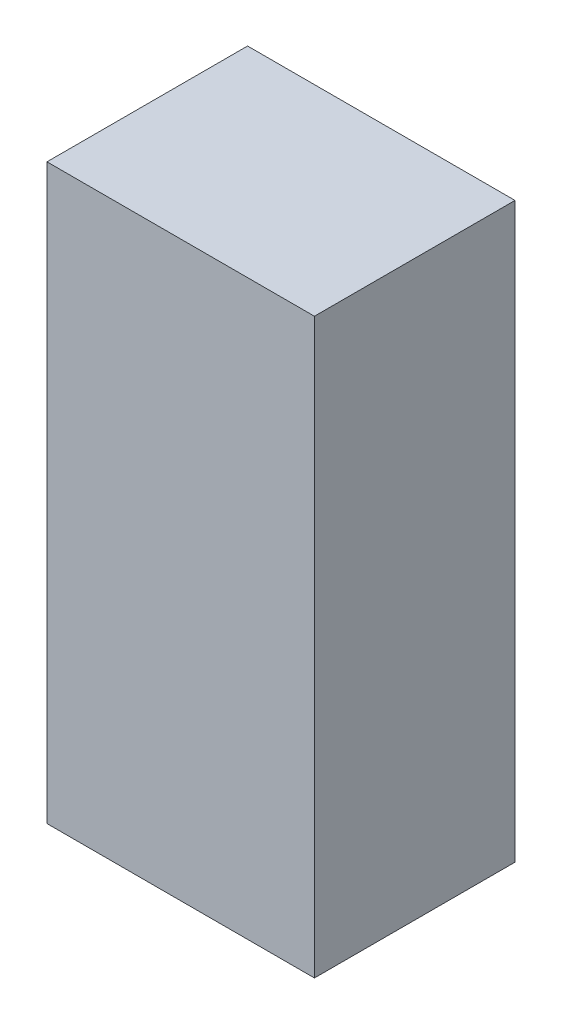
ISO-10303-21;
HEADER;
FILE_DESCRIPTION(('STEP AP214'),'2;1');
FILE_NAME('part.step','',(''),(''),'','','');
FILE_SCHEMA(('AUTOMOTIVE_DESIGN { 1 0 10303 214 1 1 1 1 }'));
ENDSEC;
DATA;
#1=APPLICATION_CONTEXT('core data for automotive mechanical design processes');
#2=APPLICATION_PROTOCOL_DEFINITION('international standard','automotive_design',2000,#1);
#3=PRODUCT_CONTEXT('',#1,'mechanical');
#4=PRODUCT('Part','Part','',(#3));
#5=PRODUCT_RELATED_PRODUCT_CATEGORY('part','',(#4));
#6=PRODUCT_DEFINITION_FORMATION('','',#4);
#7=PRODUCT_DEFINITION_CONTEXT('part definition',#1,'design');
#8=PRODUCT_DEFINITION('design','',#6,#7);
#9=PRODUCT_DEFINITION_SHAPE('','',#8);
#10=(LENGTH_UNIT() NAMED_UNIT(*) SI_UNIT(.MILLI.,.METRE.));
#11=(NAMED_UNIT(*) PLANE_ANGLE_UNIT() SI_UNIT($,.RADIAN.));
#12=(NAMED_UNIT(*) SI_UNIT($,.STERADIAN.) SOLID_ANGLE_UNIT());
#13=UNCERTAINTY_MEASURE_WITH_UNIT(LENGTH_MEASURE(1.E-05),#10,'distance_accuracy_value','');
#14=(GEOMETRIC_REPRESENTATION_CONTEXT(3) GLOBAL_UNCERTAINTY_ASSIGNED_CONTEXT((#13)) GLOBAL_UNIT_ASSIGNED_CONTEXT((#10,
#11,#12)) REPRESENTATION_CONTEXT('',''));
#15=CARTESIAN_POINT('',(0.,0.,0.));
#16=DIRECTION('',(0.,0.,1.));
#17=DIRECTION('',(1.,0.,0.));
#18=AXIS2_PLACEMENT_3D('',#15,#16,#17);
#19=CARTESIAN_POINT('',(0.70000114,1.49999954,0.0499999));
#20=DIRECTION('',(1.,0.,0.));
#21=DIRECTION('',(0.,-1.,0.));
#22=AXIS2_PLACEMENT_3D('',#19,#20,#21);
#23=PLANE('',#22);
#24=DIRECTION('',(0.,0.,1.));
#25=VECTOR('',#24,1.);
#26=CARTESIAN_POINT('',(0.70000114,1.49999954,0.0499999));
#27=LINE('',#26,#25);
#28=CARTESIAN_POINT('',(0.70000114,1.49999954,0.0499999));
#29=VERTEX_POINT('',#28);
#30=CARTESIAN_POINT('',(0.70000114,1.49999954,1.10000034));
#31=VERTEX_POINT('',#30);
#32=EDGE_CURVE('E11',#29,#31,#27,.T.);
#33=ORIENTED_EDGE('',*,*,#32,.T.);
#34=DIRECTION('',(0.,-1.,0.));
#35=VECTOR('',#34,1.);
#36=CARTESIAN_POINT('',(0.70000114,1.49999954,1.10000034));
#37=LINE('',#36,#35);
#38=CARTESIAN_POINT('',(0.70000114,-1.49999954,1.10000034));
#39=VERTEX_POINT('',#38);
#40=EDGE_CURVE('E23',#31,#39,#37,.T.);
#41=ORIENTED_EDGE('',*,*,#40,.T.);
#42=DIRECTION('',(0.,0.,1.));
#43=VECTOR('',#42,1.);
#44=CARTESIAN_POINT('',(0.70000114,-1.49999954,0.0499999));
#45=LINE('',#44,#43);
#46=CARTESIAN_POINT('',(0.70000114,-1.49999954,0.0499999));
#47=VERTEX_POINT('',#46);
#48=EDGE_CURVE('E83',#47,#39,#45,.T.);
#49=ORIENTED_EDGE('',*,*,#48,.F.);
#50=DIRECTION('',(0.,-1.,0.));
#51=VECTOR('',#50,1.);
#52=CARTESIAN_POINT('',(0.70000114,1.49999954,0.0499999));
#53=LINE('',#52,#51);
#54=EDGE_CURVE('E81',#29,#47,#53,.T.);
#55=ORIENTED_EDGE('',*,*,#54,.F.);
#56=EDGE_LOOP('',(#33,#41,#49,#55));
#57=FACE_BOUND('',#56,.T.);
#58=ADVANCED_FACE('F16',(#57),#23,.T.);
#59=CARTESIAN_POINT('',(0.70000114,-1.49999954,0.0499999));
#60=DIRECTION('',(0.,-1.,0.));
#61=DIRECTION('',(-1.,0.,0.));
#62=AXIS2_PLACEMENT_3D('',#59,#60,#61);
#63=PLANE('',#62);
#64=ORIENTED_EDGE('',*,*,#48,.T.);
#65=DIRECTION('',(-1.,0.,0.));
#66=VECTOR('',#65,1.);
#67=CARTESIAN_POINT('',(0.70000114,-1.49999954,1.10000034));
#68=LINE('',#67,#66);
#69=CARTESIAN_POINT('',(-0.6999986,-1.49999954,1.10000034));
#70=VERTEX_POINT('',#69);
#71=EDGE_CURVE('E78',#39,#70,#68,.T.);
#72=ORIENTED_EDGE('',*,*,#71,.T.);
#73=DIRECTION('',(0.,0.,1.));
#74=VECTOR('',#73,1.);
#75=CARTESIAN_POINT('',(-0.6999986,-1.49999954,0.0499999));
#76=LINE('',#75,#74);
#77=CARTESIAN_POINT('',(-0.6999986,-1.49999954,0.0499999));
#78=VERTEX_POINT('',#77);
#79=EDGE_CURVE('E76',#78,#70,#76,.T.);
#80=ORIENTED_EDGE('',*,*,#79,.F.);
#81=DIRECTION('',(-1.,0.,0.));
#82=VECTOR('',#81,1.);
#83=CARTESIAN_POINT('',(0.70000114,-1.49999954,0.0499999));
#84=LINE('',#83,#82);
#85=EDGE_CURVE('E57',#47,#78,#84,.T.);
#86=ORIENTED_EDGE('',*,*,#85,.F.);
#87=EDGE_LOOP('',(#64,#72,#80,#86));
#88=FACE_BOUND('',#87,.T.);
#89=ADVANCED_FACE('F89',(#88),#63,.T.);
#90=CARTESIAN_POINT('',(-0.6999986,-1.49999954,0.0499999));
#91=DIRECTION('',(-1.,0.,0.));
#92=DIRECTION('',(0.,1.,0.));
#93=AXIS2_PLACEMENT_3D('',#90,#91,#92);
#94=PLANE('',#93);
#95=ORIENTED_EDGE('',*,*,#79,.T.);
#96=DIRECTION('',(0.,1.,0.));
#97=VECTOR('',#96,1.);
#98=CARTESIAN_POINT('',(-0.6999986,-1.49999954,1.10000034));
#99=LINE('',#98,#97);
#100=CARTESIAN_POINT('',(-0.6999986,1.49999954,1.10000034));
#101=VERTEX_POINT('',#100);
#102=EDGE_CURVE('E70',#70,#101,#99,.T.);
#103=ORIENTED_EDGE('',*,*,#102,.T.);
#104=DIRECTION('',(0.,0.,1.));
#105=VECTOR('',#104,1.);
#106=CARTESIAN_POINT('',(-0.6999986,1.49999954,0.0499999));
#107=LINE('',#106,#105);
#108=CARTESIAN_POINT('',(-0.6999986,1.49999954,0.0499999));
#109=VERTEX_POINT('',#108);
#110=EDGE_CURVE('E61',#109,#101,#107,.T.);
#111=ORIENTED_EDGE('',*,*,#110,.F.);
#112=DIRECTION('',(0.,1.,0.));
#113=VECTOR('',#112,1.);
#114=CARTESIAN_POINT('',(-0.6999986,-1.49999954,0.0499999));
#115=LINE('',#114,#113);
#116=EDGE_CURVE('E53',#78,#109,#115,.T.);
#117=ORIENTED_EDGE('',*,*,#116,.F.);
#118=EDGE_LOOP('',(#95,#103,#111,#117));
#119=FACE_BOUND('',#118,.T.);
#120=ADVANCED_FACE('F68',(#119),#94,.T.);
#121=CARTESIAN_POINT('',(-0.6999986,1.49999954,0.0499999));
#122=DIRECTION('',(0.,1.,0.));
#123=DIRECTION('',(1.,0.,0.));
#124=AXIS2_PLACEMENT_3D('',#121,#122,#123);
#125=PLANE('',#124);
#126=ORIENTED_EDGE('',*,*,#110,.T.);
#127=DIRECTION('',(1.,0.,0.));
#128=VECTOR('',#127,1.);
#129=CARTESIAN_POINT('',(-0.6999986,1.49999954,1.10000034));
#130=LINE('',#129,#128);
#131=EDGE_CURVE('E62',#101,#31,#130,.T.);
#132=ORIENTED_EDGE('',*,*,#131,.T.);
#133=ORIENTED_EDGE('',*,*,#32,.F.);
#134=DIRECTION('',(1.,0.,0.));
#135=VECTOR('',#134,1.);
#136=CARTESIAN_POINT('',(-0.6999986,1.49999954,0.0499999));
#137=LINE('',#136,#135);
#138=EDGE_CURVE('E55',#109,#29,#137,.T.);
#139=ORIENTED_EDGE('',*,*,#138,.F.);
#140=EDGE_LOOP('',(#126,#132,#133,#139));
#141=FACE_BOUND('',#140,.T.);
#142=ADVANCED_FACE('F65',(#141),#125,.T.);
#143=CARTESIAN_POINT('',(1.269999998472E-06,0.,0.0499999));
#144=DIRECTION('',(0.,0.,-1.));
#145=DIRECTION('',(0.,1.,0.));
#146=AXIS2_PLACEMENT_3D('',#143,#144,#145);
#147=PLANE('',#146);
#148=ORIENTED_EDGE('',*,*,#54,.T.);
#149=ORIENTED_EDGE('',*,*,#85,.T.);
#150=ORIENTED_EDGE('',*,*,#116,.T.);
#151=ORIENTED_EDGE('',*,*,#138,.T.);
#152=EDGE_LOOP('',(#148,#149,#150,#151));
#153=FACE_BOUND('',#152,.T.);
#154=ADVANCED_FACE('F54',(#153),#147,.T.);
#155=CARTESIAN_POINT('',(1.269999998472E-06,0.,1.10000034));
#156=DIRECTION('',(0.,0.,-1.));
#157=DIRECTION('',(0.,1.,0.));
#158=AXIS2_PLACEMENT_3D('',#155,#156,#157);
#159=PLANE('',#158);
#160=ORIENTED_EDGE('',*,*,#131,.F.);
#161=ORIENTED_EDGE('',*,*,#102,.F.);
#162=ORIENTED_EDGE('',*,*,#71,.F.);
#163=ORIENTED_EDGE('',*,*,#40,.F.);
#164=EDGE_LOOP('',(#160,#161,#162,#163));
#165=FACE_BOUND('',#164,.T.);
#166=ADVANCED_FACE('F90',(#165),#159,.F.);
#167=CLOSED_SHELL('',(#58,#89,#120,#142,#154,#166));
#168=MANIFOLD_SOLID_BREP('B1',#167);
#169=ADVANCED_BREP_SHAPE_REPRESENTATION('',(#18,#168),#14);
#170=SHAPE_DEFINITION_REPRESENTATION(#9,#169);
ENDSEC;
END-ISO-10303-21;
